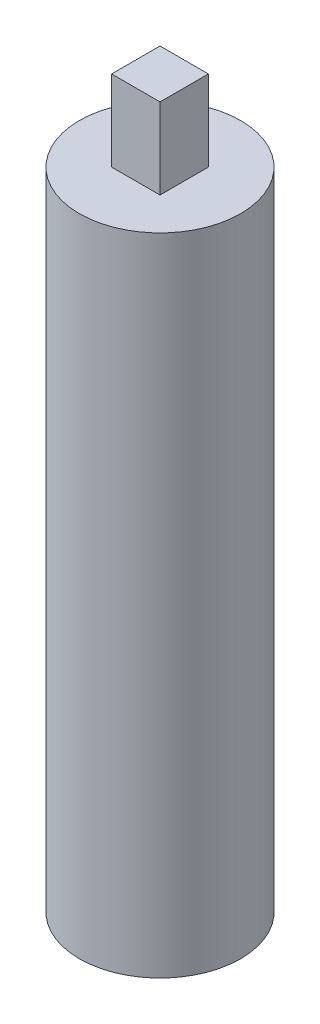
ISO-10303-21;
HEADER;
FILE_DESCRIPTION(('STEP AP214'),'2;1');
FILE_NAME('part.step','',(''),(''),'','','');
FILE_SCHEMA(('AUTOMOTIVE_DESIGN { 1 0 10303 214 1 1 1 1 }'));
ENDSEC;
DATA;
#1=APPLICATION_CONTEXT('core data for automotive mechanical design processes');
#2=APPLICATION_PROTOCOL_DEFINITION('international standard','automotive_design',2000,#1);
#3=PRODUCT_CONTEXT('',#1,'mechanical');
#4=PRODUCT('Part','Part','',(#3));
#5=PRODUCT_RELATED_PRODUCT_CATEGORY('part','',(#4));
#6=PRODUCT_DEFINITION_FORMATION('','',#4);
#7=PRODUCT_DEFINITION_CONTEXT('part definition',#1,'design');
#8=PRODUCT_DEFINITION('design','',#6,#7);
#9=PRODUCT_DEFINITION_SHAPE('','',#8);
#10=(LENGTH_UNIT() NAMED_UNIT(*) SI_UNIT(.MILLI.,.METRE.));
#11=(NAMED_UNIT(*) PLANE_ANGLE_UNIT() SI_UNIT($,.RADIAN.));
#12=(NAMED_UNIT(*) SI_UNIT($,.STERADIAN.) SOLID_ANGLE_UNIT());
#13=UNCERTAINTY_MEASURE_WITH_UNIT(LENGTH_MEASURE(1.E-05),#10,'distance_accuracy_value','');
#14=(GEOMETRIC_REPRESENTATION_CONTEXT(3) GLOBAL_UNCERTAINTY_ASSIGNED_CONTEXT((#13)) GLOBAL_UNIT_ASSIGNED_CONTEXT((#10,
#11,#12)) REPRESENTATION_CONTEXT('',''));
#15=CARTESIAN_POINT('',(0.,0.,0.));
#16=DIRECTION('',(0.,0.,1.));
#17=DIRECTION('',(1.,0.,0.));
#18=AXIS2_PLACEMENT_3D('',#15,#16,#17);
#19=CARTESIAN_POINT('',(0.,40.,0.));
#20=DIRECTION('',(0.,1.,0.));
#21=DIRECTION('',(0.,0.,1.));
#22=AXIS2_PLACEMENT_3D('',#19,#20,#21);
#23=PLANE('',#22);
#24=CARTESIAN_POINT('',(0.,40.,0.));
#25=DIRECTION('',(0.,1.,0.));
#26=DIRECTION('',(0.,0.,1.));
#27=AXIS2_PLACEMENT_3D('',#24,#25,#26);
#28=CIRCLE('',#27,5.);
#29=CARTESIAN_POINT('',(0.,40.,5.));
#30=VERTEX_POINT('',#29);
#31=EDGE_CURVE('E11',#30,#30,#28,.T.);
#32=ORIENTED_EDGE('',*,*,#31,.T.);
#33=EDGE_LOOP('',(#32));
#34=FACE_BOUND('',#33,.T.);
#35=DIRECTION('',(1.,0.,0.));
#36=VECTOR('',#35,1.);
#37=CARTESIAN_POINT('',(-1.5,40.,1.5));
#38=LINE('',#37,#36);
#39=CARTESIAN_POINT('',(-1.5,40.,1.5));
#40=VERTEX_POINT('',#39);
#41=CARTESIAN_POINT('',(1.5,40.,1.5));
#42=VERTEX_POINT('',#41);
#43=EDGE_CURVE('E89',#40,#42,#38,.T.);
#44=ORIENTED_EDGE('',*,*,#43,.F.);
#45=DIRECTION('',(0.,0.,1.));
#46=VECTOR('',#45,1.);
#47=CARTESIAN_POINT('',(-1.5,40.,-1.5));
#48=LINE('',#47,#46);
#49=CARTESIAN_POINT('',(-1.5,40.,-1.5));
#50=VERTEX_POINT('',#49);
#51=EDGE_CURVE('E100',#50,#40,#48,.T.);
#52=ORIENTED_EDGE('',*,*,#51,.F.);
#53=DIRECTION('',(-1.,0.,0.));
#54=VECTOR('',#53,1.);
#55=CARTESIAN_POINT('',(-1.5,40.,-1.5));
#56=LINE('',#55,#54);
#57=CARTESIAN_POINT('',(1.5,40.,-1.5));
#58=VERTEX_POINT('',#57);
#59=EDGE_CURVE('E70',#58,#50,#56,.T.);
#60=ORIENTED_EDGE('',*,*,#59,.F.);
#61=DIRECTION('',(0.,0.,-1.));
#62=VECTOR('',#61,1.);
#63=CARTESIAN_POINT('',(1.5,40.,-1.5));
#64=LINE('',#63,#62);
#65=EDGE_CURVE('E104',#42,#58,#64,.T.);
#66=ORIENTED_EDGE('',*,*,#65,.F.);
#67=EDGE_LOOP('',(#44,#52,#60,#66));
#68=FACE_BOUND('',#67,.T.);
#69=ADVANCED_FACE('F33',(#34,#68),#23,.T.);
#70=CARTESIAN_POINT('',(0.,40.,0.));
#71=DIRECTION('',(0.,-1.,0.));
#72=DIRECTION('',(0.,0.,-1.));
#73=AXIS2_PLACEMENT_3D('',#70,#71,#72);
#74=CYLINDRICAL_SURFACE('',#73,5.);
#75=ORIENTED_EDGE('',*,*,#31,.F.);
#76=EDGE_LOOP('',(#75));
#77=FACE_BOUND('',#76,.T.);
#78=CARTESIAN_POINT('',(0.,0.,0.));
#79=DIRECTION('',(0.,1.,0.));
#80=DIRECTION('',(0.,0.,1.));
#81=AXIS2_PLACEMENT_3D('',#78,#79,#80);
#82=CIRCLE('',#81,5.);
#83=CARTESIAN_POINT('',(0.,0.,5.));
#84=VERTEX_POINT('',#83);
#85=EDGE_CURVE('E37',#84,#84,#82,.T.);
#86=ORIENTED_EDGE('',*,*,#85,.T.);
#87=EDGE_LOOP('',(#86));
#88=FACE_BOUND('',#87,.T.);
#89=ADVANCED_FACE('F35',(#77,#88),#74,.T.);
#90=CARTESIAN_POINT('',(0.,0.,0.));
#91=DIRECTION('',(0.,1.,0.));
#92=DIRECTION('',(0.,0.,1.));
#93=AXIS2_PLACEMENT_3D('',#90,#91,#92);
#94=PLANE('',#93);
#95=ORIENTED_EDGE('',*,*,#85,.F.);
#96=EDGE_LOOP('',(#95));
#97=FACE_BOUND('',#96,.T.);
#98=ADVANCED_FACE('F113',(#97),#94,.F.);
#99=CARTESIAN_POINT('',(-1.5,45.,-1.5));
#100=DIRECTION('',(1.,0.,0.));
#101=DIRECTION('',(0.,0.,-1.));
#102=AXIS2_PLACEMENT_3D('',#99,#100,#101);
#103=PLANE('',#102);
#104=ORIENTED_EDGE('',*,*,#51,.T.);
#105=DIRECTION('',(0.,-1.,0.));
#106=VECTOR('',#105,1.);
#107=CARTESIAN_POINT('',(-1.5,45.,1.5));
#108=LINE('',#107,#106);
#109=CARTESIAN_POINT('',(-1.5,45.,1.5));
#110=VERTEX_POINT('',#109);
#111=EDGE_CURVE('E92',#110,#40,#108,.T.);
#112=ORIENTED_EDGE('',*,*,#111,.F.);
#113=DIRECTION('',(0.,0.,1.));
#114=VECTOR('',#113,1.);
#115=CARTESIAN_POINT('',(-1.5,45.,-1.5));
#116=LINE('',#115,#114);
#117=CARTESIAN_POINT('',(-1.5,45.,-1.5));
#118=VERTEX_POINT('',#117);
#119=EDGE_CURVE('E82',#118,#110,#116,.T.);
#120=ORIENTED_EDGE('',*,*,#119,.F.);
#121=DIRECTION('',(0.,-1.,0.));
#122=VECTOR('',#121,1.);
#123=CARTESIAN_POINT('',(-1.5,45.,-1.5));
#124=LINE('',#123,#122);
#125=EDGE_CURVE('E96',#118,#50,#124,.T.);
#126=ORIENTED_EDGE('',*,*,#125,.T.);
#127=EDGE_LOOP('',(#104,#112,#120,#126));
#128=FACE_BOUND('',#127,.T.);
#129=ADVANCED_FACE('F115',(#128),#103,.F.);
#130=CARTESIAN_POINT('',(-1.5,45.,1.5));
#131=DIRECTION('',(0.,0.,-1.));
#132=DIRECTION('',(-1.,0.,0.));
#133=AXIS2_PLACEMENT_3D('',#130,#131,#132);
#134=PLANE('',#133);
#135=ORIENTED_EDGE('',*,*,#43,.T.);
#136=DIRECTION('',(0.,-1.,0.));
#137=VECTOR('',#136,1.);
#138=CARTESIAN_POINT('',(1.5,45.,1.5));
#139=LINE('',#138,#137);
#140=CARTESIAN_POINT('',(1.5,45.,1.5));
#141=VERTEX_POINT('',#140);
#142=EDGE_CURVE('E86',#141,#42,#139,.T.);
#143=ORIENTED_EDGE('',*,*,#142,.F.);
#144=DIRECTION('',(1.,0.,0.));
#145=VECTOR('',#144,1.);
#146=CARTESIAN_POINT('',(-1.5,45.,1.5));
#147=LINE('',#146,#145);
#148=EDGE_CURVE('E77',#110,#141,#147,.T.);
#149=ORIENTED_EDGE('',*,*,#148,.F.);
#150=ORIENTED_EDGE('',*,*,#111,.T.);
#151=EDGE_LOOP('',(#135,#143,#149,#150));
#152=FACE_BOUND('',#151,.T.);
#153=ADVANCED_FACE('F87',(#152),#134,.F.);
#154=CARTESIAN_POINT('',(1.5,45.,-1.5));
#155=DIRECTION('',(-1.,0.,0.));
#156=DIRECTION('',(0.,0.,1.));
#157=AXIS2_PLACEMENT_3D('',#154,#155,#156);
#158=PLANE('',#157);
#159=ORIENTED_EDGE('',*,*,#65,.T.);
#160=DIRECTION('',(0.,-1.,0.));
#161=VECTOR('',#160,1.);
#162=CARTESIAN_POINT('',(1.5,45.,-1.5));
#163=LINE('',#162,#161);
#164=CARTESIAN_POINT('',(1.5,45.,-1.5));
#165=VERTEX_POINT('',#164);
#166=EDGE_CURVE('E48',#165,#58,#163,.T.);
#167=ORIENTED_EDGE('',*,*,#166,.F.);
#168=DIRECTION('',(0.,0.,-1.));
#169=VECTOR('',#168,1.);
#170=CARTESIAN_POINT('',(1.5,45.,-1.5));
#171=LINE('',#170,#169);
#172=EDGE_CURVE('E80',#141,#165,#171,.T.);
#173=ORIENTED_EDGE('',*,*,#172,.F.);
#174=ORIENTED_EDGE('',*,*,#142,.T.);
#175=EDGE_LOOP('',(#159,#167,#173,#174));
#176=FACE_BOUND('',#175,.T.);
#177=ADVANCED_FACE('F94',(#176),#158,.F.);
#178=CARTESIAN_POINT('',(-1.5,45.,-1.5));
#179=DIRECTION('',(0.,0.,1.));
#180=DIRECTION('',(1.,0.,0.));
#181=AXIS2_PLACEMENT_3D('',#178,#179,#180);
#182=PLANE('',#181);
#183=ORIENTED_EDGE('',*,*,#59,.T.);
#184=ORIENTED_EDGE('',*,*,#125,.F.);
#185=DIRECTION('',(-1.,0.,0.));
#186=VECTOR('',#185,1.);
#187=CARTESIAN_POINT('',(-1.5,45.,-1.5));
#188=LINE('',#187,#186);
#189=EDGE_CURVE('E56',#165,#118,#188,.T.);
#190=ORIENTED_EDGE('',*,*,#189,.F.);
#191=ORIENTED_EDGE('',*,*,#166,.T.);
#192=EDGE_LOOP('',(#183,#184,#190,#191));
#193=FACE_BOUND('',#192,.T.);
#194=ADVANCED_FACE('F134',(#193),#182,.F.);
#195=CARTESIAN_POINT('',(0.,45.,0.));
#196=DIRECTION('',(0.,1.,0.));
#197=DIRECTION('',(0.,0.,1.));
#198=AXIS2_PLACEMENT_3D('',#195,#196,#197);
#199=PLANE('',#198);
#200=ORIENTED_EDGE('',*,*,#119,.T.);
#201=ORIENTED_EDGE('',*,*,#148,.T.);
#202=ORIENTED_EDGE('',*,*,#172,.T.);
#203=ORIENTED_EDGE('',*,*,#189,.T.);
#204=EDGE_LOOP('',(#200,#201,#202,#203));
#205=FACE_BOUND('',#204,.T.);
#206=ADVANCED_FACE('F78',(#205),#199,.T.);
#207=CLOSED_SHELL('',(#69,#89,#98,#129,#153,#177,#194,#206));
#208=MANIFOLD_SOLID_BREP('B2',#207);
#209=ADVANCED_BREP_SHAPE_REPRESENTATION('',(#18,#208),#14);
#210=SHAPE_DEFINITION_REPRESENTATION(#9,#209);
ENDSEC;
END-ISO-10303-21;
